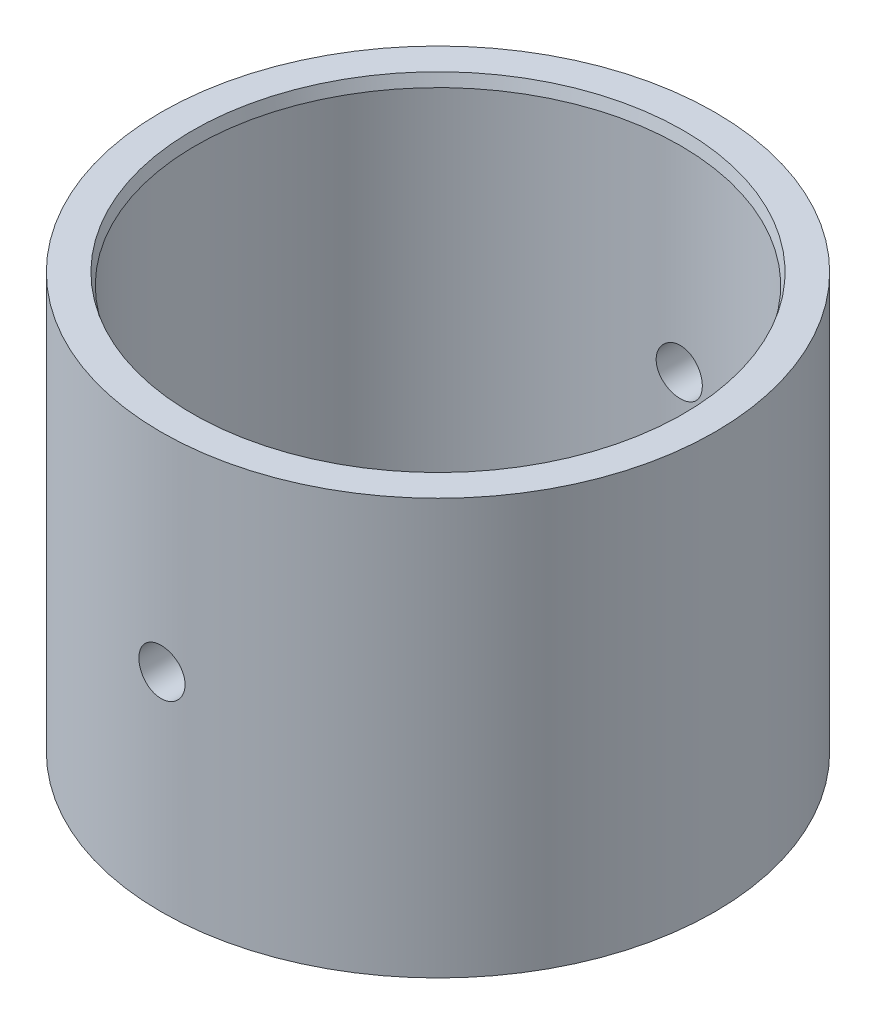
ISO-10303-21;
HEADER;
FILE_DESCRIPTION(('STEP AP214'),'2;1');
FILE_NAME('part.step','',(''),(''),'','','');
FILE_SCHEMA(('AUTOMOTIVE_DESIGN { 1 0 10303 214 1 1 1 1 }'));
ENDSEC;
DATA;
#1=APPLICATION_CONTEXT('core data for automotive mechanical design processes');
#2=APPLICATION_PROTOCOL_DEFINITION('international standard','automotive_design',2000,#1);
#3=PRODUCT_CONTEXT('',#1,'mechanical');
#4=PRODUCT('Part','Part','',(#3));
#5=PRODUCT_RELATED_PRODUCT_CATEGORY('part','',(#4));
#6=PRODUCT_DEFINITION_FORMATION('','',#4);
#7=PRODUCT_DEFINITION_CONTEXT('part definition',#1,'design');
#8=PRODUCT_DEFINITION('design','',#6,#7);
#9=PRODUCT_DEFINITION_SHAPE('','',#8);
#10=(LENGTH_UNIT() NAMED_UNIT(*) SI_UNIT(.MILLI.,.METRE.));
#11=(NAMED_UNIT(*) PLANE_ANGLE_UNIT() SI_UNIT($,.RADIAN.));
#12=(NAMED_UNIT(*) SI_UNIT($,.STERADIAN.) SOLID_ANGLE_UNIT());
#13=UNCERTAINTY_MEASURE_WITH_UNIT(LENGTH_MEASURE(1.E-05),#10,'distance_accuracy_value','');
#14=(GEOMETRIC_REPRESENTATION_CONTEXT(3) GLOBAL_UNCERTAINTY_ASSIGNED_CONTEXT((#13)) GLOBAL_UNIT_ASSIGNED_CONTEXT((#10,
#11,#12)) REPRESENTATION_CONTEXT('',''));
#15=CARTESIAN_POINT('',(0.,0.,0.));
#16=DIRECTION('',(0.,0.,1.));
#17=DIRECTION('',(1.,0.,0.));
#18=AXIS2_PLACEMENT_3D('',#15,#16,#17);
#19=CARTESIAN_POINT('',(0.,0.,0.));
#20=DIRECTION('',(0.,-1.,0.));
#21=DIRECTION('',(0.,0.,-1.));
#22=AXIS2_PLACEMENT_3D('',#19,#20,#21);
#23=CYLINDRICAL_SURFACE('',#22,24.);
#24=CARTESIAN_POINT('',(0.,20.,-24.));
#25=CARTESIAN_POINT('',(-0.112132179842408,19.9999951023475,-23.9999989082303));
#26=CARTESIAN_POINT('',(-0.224340694360451,19.9905380603779,-23.9992057708679));
#27=CARTESIAN_POINT('',(-0.445653141400779,19.9529512962899,-23.996118046565));
#28=CARTESIAN_POINT('',(-0.55475341045046,19.9248004193902,-23.9938217586339));
#29=CARTESIAN_POINT('',(-0.766612045028522,19.8506456923813,-23.9879872249221));
#30=CARTESIAN_POINT('',(-0.869373960849232,19.8046519437804,-23.9844496819697));
#31=CARTESIAN_POINT('',(-1.06569446683215,19.696135136256,-23.9765293548943));
#32=CARTESIAN_POINT('',(-1.15925501977078,19.633615613045,-23.9721467516272));
#33=CARTESIAN_POINT('',(-1.33477999993118,19.493649866788,-23.9630155973343));
#34=CARTESIAN_POINT('',(-1.41671774483233,19.4161702321286,-23.9582662417315));
#35=CARTESIAN_POINT('',(-1.56644226707311,19.2485542083002,-23.9489436160634));
#36=CARTESIAN_POINT('',(-1.63422842274301,19.1584172633948,-23.9443703537408));
#37=CARTESIAN_POINT('',(-1.75381584478046,18.967883765802,-23.9359090532249));
#38=CARTESIAN_POINT('',(-1.80559366590309,18.8674724491945,-23.9320220236018));
#39=CARTESIAN_POINT('',(-1.89154486754769,18.6593434088881,-23.9253824889655));
#40=CARTESIAN_POINT('',(-1.92571855902484,18.5516258142835,-23.9226299639126));
#41=CARTESIAN_POINT('',(-1.97541405963714,18.3322092162377,-23.9185778413264));
#42=CARTESIAN_POINT('',(-1.99097933077955,18.2205201200148,-23.9172748587244));
#43=CARTESIAN_POINT('',(-2.00315041603086,17.9961075921093,-23.9162586464295));
#44=CARTESIAN_POINT('',(-1.99975658595908,17.883384179878,-23.9165453869012));
#45=CARTESIAN_POINT('',(-1.9741417284297,17.660400668979,-23.9186731472327));
#46=CARTESIAN_POINT('',(-1.95196793607612,17.5501351018472,-23.9205102675571));
#47=CARTESIAN_POINT('',(-1.88949597076588,17.3348962652141,-23.9255256713873));
#48=CARTESIAN_POINT('',(-1.84919762079357,17.2299230474123,-23.928703967992));
#49=CARTESIAN_POINT('',(-1.75156757630407,17.0280981882438,-23.9360480941371));
#50=CARTESIAN_POINT('',(-1.69421468951439,16.931256844825,-23.9402151510193));
#51=CARTESIAN_POINT('',(-1.5641188878267,16.7485573223604,-23.9490661372776));
#52=CARTESIAN_POINT('',(-1.49137566124509,16.6626993658056,-23.9537500771206));
#53=CARTESIAN_POINT('',(-1.33229916445273,16.5041291614369,-23.9631244082329));
#54=CARTESIAN_POINT('',(-1.24592505878115,16.4314578717415,-23.9678147755013));
#55=CARTESIAN_POINT('',(-1.06218111274351,16.3016405532229,-23.9766598373967));
#56=CARTESIAN_POINT('',(-0.964811265030679,16.2444945347729,-23.9808145316657));
#57=CARTESIAN_POINT('',(-0.761813186535707,16.1473524746626,-23.9881209161928));
#58=CARTESIAN_POINT('',(-0.656184083618153,16.1073582470437,-23.9912725003489));
#59=CARTESIAN_POINT('',(-0.439678138039168,16.0456837350974,-23.996216348236));
#60=CARTESIAN_POINT('',(-0.328801404337715,16.0240030706895,-23.9980086401777));
#61=CARTESIAN_POINT('',(-0.105302600328507,15.9996224719169,-24.000028338861));
#62=CARTESIAN_POINT('',(0.00731325823038711,15.9968659637862,-24.00026040984));
#63=CARTESIAN_POINT('',(0.231405505006602,16.0102637212546,-23.999145975574));
#64=CARTESIAN_POINT('',(0.342881903842822,16.0264178104589,-23.9977994850535));
#65=CARTESIAN_POINT('',(0.561369512449395,16.0771313172202,-23.9936823568264));
#66=CARTESIAN_POINT('',(0.66838685027944,16.1116645120516,-23.9909137483484));
#67=CARTESIAN_POINT('',(0.875108330164975,16.1981291755641,-23.984263402247));
#68=CARTESIAN_POINT('',(0.974812356566261,16.250060919317,-23.9803816470248));
#69=CARTESIAN_POINT('',(1.16433443660381,16.3699906984327,-23.9719285278726));
#70=CARTESIAN_POINT('',(1.25412870104294,16.4380262127897,-23.9673555643747));
#71=CARTESIAN_POINT('',(1.42104218968724,16.588178114101,-23.958039172794));
#72=CARTESIAN_POINT('',(1.49816119362876,16.6702947456986,-23.9532957417505));
#73=CARTESIAN_POINT('',(1.6377290909102,16.8465233843967,-23.9441592243164));
#74=CARTESIAN_POINT('',(1.70014106646727,16.9406646823948,-23.9397670374845));
#75=CARTESIAN_POINT('',(1.80827012567903,17.1381245257268,-23.9318430348864));
#76=CARTESIAN_POINT('',(1.85398737601992,17.2414429794199,-23.9283112105303));
#77=CARTESIAN_POINT('',(1.92736635488113,17.4541935810785,-23.9225128569788));
#78=CARTESIAN_POINT('',(1.95505068289858,17.5636178894287,-23.9202447445727));
#79=CARTESIAN_POINT('',(1.9916515398203,17.7855813997489,-23.917225313817));
#80=CARTESIAN_POINT('',(2.00056842913653,17.8981205418592,-23.9164739663394));
#81=CARTESIAN_POINT('',(1.99937712578186,18.1227522520418,-23.9165735590039));
#82=CARTESIAN_POINT('',(1.98932693955478,18.2348451344729,-23.9174196138614));
#83=CARTESIAN_POINT('',(1.95060772659006,18.4557450671017,-23.9206083016461));
#84=CARTESIAN_POINT('',(1.92193867145525,18.5645521122877,-23.9229509368559));
#85=CARTESIAN_POINT('',(1.84681022003412,18.7757955265333,-23.9288675426341));
#86=CARTESIAN_POINT('',(1.80035186801306,18.8782322691314,-23.9324414409238));
#87=CARTESIAN_POINT('',(1.6909701178945,19.0738616811474,-23.9404179975014));
#88=CARTESIAN_POINT('',(1.62804697822912,19.1670544956267,-23.944820642781));
#89=CARTESIAN_POINT('',(1.4873038842449,19.341847478026,-23.9539746339736));
#90=CARTESIAN_POINT('',(1.40944098748292,19.4234130173147,-23.9587269601149));
#91=CARTESIAN_POINT('',(1.24110645118493,19.5723503704067,-23.9680359001936));
#92=CARTESIAN_POINT('',(1.15063176528218,19.639718744992,-23.9725924664965));
#93=CARTESIAN_POINT('',(0.95946754605883,19.7584397208351,-23.9810046968455));
#94=CARTESIAN_POINT('',(0.858759312541077,19.8097622773127,-23.9848590404621));
#95=CARTESIAN_POINT('',(0.650191503991467,19.8947036061026,-23.991417050326));
#96=CARTESIAN_POINT('',(0.542340310827302,19.9283427285762,-23.9941220385651));
#97=CARTESIAN_POINT('',(0.361544096193359,19.9683951650041,-23.997382154677));
#98=CARTESIAN_POINT('',(0.289761788876941,19.980231225035,-23.9983593775391));
#99=CARTESIAN_POINT('',(0.145330343002325,19.9960352193544,-23.9996686531727));
#100=CARTESIAN_POINT('',(0.0726812067460898,20.000003174533,-24.0000007076571));
#101=CARTESIAN_POINT('',(0.,20.,-24.));
#102=B_SPLINE_CURVE_WITH_KNOTS('',3,(#24,#25,#26,#27,#28,#29,#30,#31,#32,#33,#34,#35,#36,#37,
#38,#39,#40,#41,#42,#43,#44,#45,#46,#47,#48,#49,#50,#51,#52,#53,#54,#55,#56,#57,#58,#59,#60,#61,
#62,#63,#64,#65,#66,#67,#68,#69,#70,#71,#72,#73,#74,#75,#76,#77,#78,#79,#80,#81,#82,#83,#84,#85,
#86,#87,#88,#89,#90,#91,#92,#93,#94,#95,#96,#97,#98,#99,#100,#101),.UNSPECIFIED.,.T.,.F.,(4,2,2,
2,2,2,2,2,2,2,2,2,2,2,2,2,2,2,2,2,2,2,2,2,2,2,2,2,2,2,2,2,2,2,2,2,2,2,4),(0.,0.336131173600278,
0.672643377995671,1.00896534777791,1.34521541916836,1.68222533757153,2.01925005747863,
2.35676605902183,2.69427609855802,3.03099629663173,3.36771017525238,3.70357966220579,
4.03945242953998,4.37574431497799,4.7120430116172,5.04936901870299,5.3866952511729,
5.72405715180901,6.0614120506507,6.39775798614337,6.73410078428443,7.06996498061571,
7.40583448722745,7.74249349949854,8.07915836142501,8.41665952982404,8.75415732839656,
9.09123134481857,9.42829888797516,9.76433725765055,10.1003761398468,10.4363952989505,
10.7724091841971,11.1094037732928,11.4464799046496,11.7841834612511,12.1214975318357,
12.3393697271332,12.5572413439749),.UNSPECIFIED.);
#103=CARTESIAN_POINT('',(0.,20.,-24.));
#104=VERTEX_POINT('',#103);
#105=EDGE_CURVE('E75',#104,#104,#102,.T.);
#106=ORIENTED_EDGE('',*,*,#105,.T.);
#107=EDGE_LOOP('',(#106));
#108=FACE_BOUND('',#107,.T.);
#109=CARTESIAN_POINT('',(2.,18.,23.9165214862028));
#110=CARTESIAN_POINT('',(1.99999510166076,17.8878685824192,23.9165225921672));
#111=CARTESIAN_POINT('',(1.99053818391964,17.7756608276847,23.9173185596524));
#112=CARTESIAN_POINT('',(1.95295195814858,17.5543499593132,23.9204163949853));
#113=CARTESIAN_POINT('',(1.92480149272331,17.4452505097448,23.9227199691026));
#114=CARTESIAN_POINT('',(1.85064796947505,17.2333936077494,23.9285703099202));
#115=CARTESIAN_POINT('',(1.80465503275105,17.1306325980901,23.9321163717121));
#116=CARTESIAN_POINT('',(1.69614013697091,16.9343136095802,23.9400512540324));
#117=CARTESIAN_POINT('',(1.63362171162538,16.8407536690899,23.944439894334));
#118=CARTESIAN_POINT('',(1.49365707291607,16.6652279938667,23.9535780955897));
#119=CARTESIAN_POINT('',(1.41617720280375,16.5832891362741,23.9583284553806));
#120=CARTESIAN_POINT('',(1.24856024135219,16.433562467524,23.9676475322155));
#121=CARTESIAN_POINT('',(1.15842259730736,16.3657752746248,23.9722162413165));
#122=CARTESIAN_POINT('',(0.96788849061758,16.2461867706877,23.9806648101503));
#123=CARTESIAN_POINT('',(0.867477384251718,16.1944087136371,23.9845436643989));
#124=CARTESIAN_POINT('',(0.659348800997525,16.108457017763,23.9911668754458));
#125=CARTESIAN_POINT('',(0.551631452032323,16.0742830708036,23.9939112521013));
#126=CARTESIAN_POINT('',(0.332215591895622,16.0245870322879,23.9979507090534));
#127=CARTESIAN_POINT('',(0.220526992464643,16.0090214577611,23.999249167599));
#128=CARTESIAN_POINT('',(-0.00388456377963857,15.9968495936308,24.0002619346845));
#129=CARTESIAN_POINT('',(-0.116607501319097,16.0002429514602,23.9999762726832));
#130=CARTESIAN_POINT('',(-0.33959310303763,16.0258570643588,23.9978557727758));
#131=CARTESIAN_POINT('',(-0.449861180144931,16.0480310596084,23.9960247824506));
#132=CARTESIAN_POINT('',(-0.665104932080491,16.1105043019242,23.9910239970924));
#133=CARTESIAN_POINT('',(-0.770080556543006,16.1508037214451,23.9878541893213));
#134=CARTESIAN_POINT('',(-0.971908321273714,16.2484359742372,23.9805257582459));
#135=CARTESIAN_POINT('',(-1.06875028531795,16.3057897491975,23.9763659205073));
#136=CARTESIAN_POINT('',(-1.25145067175474,16.4358874431573,23.967524905385));
#137=CARTESIAN_POINT('',(-1.33730887129974,16.5086316743313,23.9628437174275));
#138=CARTESIAN_POINT('',(-1.4958779295638,16.6677088799105,23.9534692949454));
#139=CARTESIAN_POINT('',(-1.56854803333006,16.7540824856376,23.9487760670533));
#140=CARTESIAN_POINT('',(-1.69836319784541,16.9378250102327,23.9399208354476));
#141=CARTESIAN_POINT('',(-1.75550824579663,17.0351939381644,23.9357588321719));
#142=CARTESIAN_POINT('',(-1.85264960918651,17.2381917755436,23.9284365219397));
#143=CARTESIAN_POINT('',(-1.8926438094694,17.3438217018938,23.9252763385469));
#144=CARTESIAN_POINT('',(-1.95431801405702,17.560329436102,23.9203178655996));
#145=CARTESIAN_POINT('',(-1.97599840338961,17.6712071335796,23.9185195474136));
#146=CARTESIAN_POINT('',(-2.00037796582524,17.8947063731106,23.9164930579307));
#147=CARTESIAN_POINT('',(-2.00313397223578,18.0073216748938,23.9162601853648));
#148=CARTESIAN_POINT('',(-1.98973541008965,18.2314126872993,23.9173785442764));
#149=CARTESIAN_POINT('',(-1.97358101791765,18.3428884085411,23.9187297609784));
#150=CARTESIAN_POINT('',(-1.92286760248496,18.5613727115991,23.9228597628949));
#151=CARTESIAN_POINT('',(-1.8883351019789,18.6683874919262,23.9256364906494));
#152=CARTESIAN_POINT('',(-1.80187268445968,18.8751041643275,23.9323029395923));
#153=CARTESIAN_POINT('',(-1.74994248829414,18.9748059390306,23.9361926786391));
#154=CARTESIAN_POINT('',(-1.6300149759579,19.1643265044385,23.9446582692637));
#155=CARTESIAN_POINT('',(-1.56197978737008,19.2541212567969,23.9492357286682));
#156=CARTESIAN_POINT('',(-1.41182825683102,19.4210358818137,23.9585555554756));
#157=CARTESIAN_POINT('',(-1.32971167257854,19.4981555363247,23.9632979257151));
#158=CARTESIAN_POINT('',(-1.15348274582349,19.6377248115401,23.9724272221765));
#159=CARTESIAN_POINT('',(-1.05934110481966,19.7001375060063,23.9768132359615));
#160=CARTESIAN_POINT('',(-0.861880386428811,19.8082678271291,23.9847224774212));
#161=CARTESIAN_POINT('',(-0.758561400763555,19.8539856206174,23.9882457137175));
#162=CARTESIAN_POINT('',(-0.545811157534078,19.9273649648322,23.994028224387));
#163=CARTESIAN_POINT('',(-0.436387821041215,19.9550493502917,23.9962890967033));
#164=CARTESIAN_POINT('',(-0.214426358132601,19.9916506515082,23.9992986265966));
#165=CARTESIAN_POINT('',(-0.10188829071566,20.0005679225032,24.0000473127974));
#166=CARTESIAN_POINT('',(0.122744096791801,19.9993777207981,23.9999481574676));
#167=CARTESIAN_POINT('',(0.23483872842277,19.9893277963229,23.9991051452937));
#168=CARTESIAN_POINT('',(0.455742224122665,19.9506084909769,23.9959268679109));
#169=CARTESIAN_POINT('',(0.564551083728559,19.9219390848166,23.9935916006751));
#170=CARTESIAN_POINT('',(0.775798092897501,19.8468092597553,23.9876908340787));
#171=CARTESIAN_POINT('',(0.878236612240519,19.8003498746341,23.9841254062043));
#172=CARTESIAN_POINT('',(1.07386914579804,19.6909655092046,23.9761631992158));
#173=CARTESIAN_POINT('',(1.16706330617211,19.6280407892816,23.9717664332491));
#174=CARTESIAN_POINT('',(1.34185617885092,19.4872959703018,23.9626191700326));
#175=CARTESIAN_POINT('',(1.42342055196923,19.4094332893069,23.9578676858697));
#176=CARTESIAN_POINT('',(1.57235565311909,19.2410996625481,23.9485548996043));
#177=CARTESIAN_POINT('',(1.63972293889646,19.1506256678342,23.9439936438395));
#178=CARTESIAN_POINT('',(1.75844275795771,18.9594619985981,23.9355684881736));
#179=CARTESIAN_POINT('',(1.80976504691693,18.8587534999976,23.9317059109641));
#180=CARTESIAN_POINT('',(1.89470580186759,18.6501851265308,23.9251315921052));
#181=CARTESIAN_POINT('',(1.92834462185893,18.5423336351656,23.922418528046));
#182=CARTESIAN_POINT('',(1.96839619601217,18.3615382315456,23.9191481637613));
#183=CARTESIAN_POINT('',(1.98023186811687,18.2897570944429,23.9181676877811));
#184=CARTESIAN_POINT('',(1.99603534701332,18.1453279936503,23.916853991446));
#185=CARTESIAN_POINT('',(2.0000031749483,18.0726800322904,23.9165207693517));
#186=CARTESIAN_POINT('',(2.,18.,23.9165214862028));
#187=B_SPLINE_CURVE_WITH_KNOTS('',3,(#109,#110,#111,#112,#113,#114,#115,#116,#117,#118,#119,
#120,#121,#122,#123,#124,#125,#126,#127,#128,#129,#130,#131,#132,#133,#134,#135,#136,#137,#138,
#139,#140,#141,#142,#143,#144,#145,#146,#147,#148,#149,#150,#151,#152,#153,#154,#155,#156,#157,
#158,#159,#160,#161,#162,#163,#164,#165,#166,#167,#168,#169,#170,#171,#172,#173,#174,#175,#176,
#177,#178,#179,#180,#181,#182,#183,#184,#185,#186),.UNSPECIFIED.,.T.,.F.,(4,2,2,2,2,2,2,2,2,2,2,
2,2,2,2,2,2,2,2,2,2,2,2,2,2,2,2,2,2,2,2,2,2,2,2,2,2,2,4),(0.,0.336128884101191,
0.672638849434344,1.00895820875438,1.34520570967165,1.6822186237835,2.01924625824601,
2.35676116520944,2.69427016423555,3.03098894044045,3.36770145492209,3.70357808249366,
4.03945790583951,4.3757518840201,4.71205268412495,5.04937568045611,5.38669895485413,
5.72406381822961,6.06142158870086,6.39776576859814,6.73410681130696,7.06996376739613,
7.4058261126909,7.74248625686011,8.07915219458568,8.41665463473969,8.75415370214925,
9.09122457762007,9.42828907270388,9.7643325267479,10.100376437216,10.4364008230566,
10.7724198952774,11.1094114464739,11.4464846115476,11.7841893707743,12.1215045697477,
12.339373248552,12.5572413418775),.UNSPECIFIED.);
#188=CARTESIAN_POINT('',(2.,18.,23.9165214862028));
#189=VERTEX_POINT('',#188);
#190=EDGE_CURVE('E71',#189,#189,#187,.T.);
#191=ORIENTED_EDGE('',*,*,#190,.T.);
#192=EDGE_LOOP('',(#191));
#193=FACE_BOUND('',#192,.T.);
#194=CARTESIAN_POINT('',(0.,0.,0.));
#195=DIRECTION('',(0.,-1.,0.));
#196=DIRECTION('',(0.,0.,-1.));
#197=AXIS2_PLACEMENT_3D('',#194,#195,#196);
#198=CIRCLE('',#197,24.);
#199=CARTESIAN_POINT('',(0.,0.,-24.));
#200=VERTEX_POINT('',#199);
#201=EDGE_CURVE('E80',#200,#200,#198,.T.);
#202=ORIENTED_EDGE('',*,*,#201,.F.);
#203=EDGE_LOOP('',(#202));
#204=FACE_BOUND('',#203,.T.);
#205=CARTESIAN_POINT('',(0.,36.,0.));
#206=DIRECTION('',(0.,-1.,0.));
#207=DIRECTION('',(0.,0.,-1.));
#208=AXIS2_PLACEMENT_3D('',#205,#206,#207);
#209=CIRCLE('',#208,24.);
#210=CARTESIAN_POINT('',(0.,36.,-24.));
#211=VERTEX_POINT('',#210);
#212=EDGE_CURVE('E10',#211,#211,#209,.T.);
#213=ORIENTED_EDGE('',*,*,#212,.T.);
#214=EDGE_LOOP('',(#213));
#215=FACE_BOUND('',#214,.T.);
#216=ADVANCED_FACE('F31',(#108,#193,#204,#215),#23,.T.);
#217=CARTESIAN_POINT('',(-24.,36.,0.));
#218=DIRECTION('',(0.,-1.,0.));
#219=DIRECTION('',(0.,0.,-1.));
#220=AXIS2_PLACEMENT_3D('',#217,#218,#219);
#221=PLANE('',#220);
#222=ORIENTED_EDGE('',*,*,#212,.F.);
#223=EDGE_LOOP('',(#222));
#224=FACE_BOUND('',#223,.T.);
#225=CARTESIAN_POINT('',(0.,36.,0.));
#226=DIRECTION('',(0.,-1.,0.));
#227=DIRECTION('',(0.,0.,-1.));
#228=AXIS2_PLACEMENT_3D('',#225,#226,#227);
#229=CIRCLE('',#228,21.2679491924311);
#230=CARTESIAN_POINT('',(0.,36.,-21.2679491924311));
#231=VERTEX_POINT('',#230);
#232=EDGE_CURVE('E43',#231,#231,#229,.T.);
#233=ORIENTED_EDGE('',*,*,#232,.T.);
#234=EDGE_LOOP('',(#233));
#235=FACE_BOUND('',#234,.T.);
#236=ADVANCED_FACE('F108',(#224,#235),#221,.F.);
#237=CARTESIAN_POINT('',(0.,35.,0.));
#238=DIRECTION('',(0.,1.,0.));
#239=DIRECTION('',(0.,0.,1.));
#240=AXIS2_PLACEMENT_3D('',#237,#238,#239);
#241=CONICAL_SURFACE('',#240,21.,0.26179938779915);
#242=ORIENTED_EDGE('',*,*,#232,.F.);
#243=EDGE_LOOP('',(#242));
#244=FACE_BOUND('',#243,.T.);
#245=CARTESIAN_POINT('',(0.,35.,0.));
#246=DIRECTION('',(0.,-1.,0.));
#247=DIRECTION('',(0.,0.,-1.));
#248=AXIS2_PLACEMENT_3D('',#245,#246,#247);
#249=CIRCLE('',#248,21.);
#250=CARTESIAN_POINT('',(0.,35.,-21.));
#251=VERTEX_POINT('',#250);
#252=EDGE_CURVE('E48',#251,#251,#249,.T.);
#253=ORIENTED_EDGE('',*,*,#252,.T.);
#254=EDGE_LOOP('',(#253));
#255=FACE_BOUND('',#254,.T.);
#256=ADVANCED_FACE('F91',(#244,#255),#241,.F.);
#257=CARTESIAN_POINT('',(0.,0.,0.));
#258=DIRECTION('',(0.,-1.,0.));
#259=DIRECTION('',(0.,0.,-1.));
#260=AXIS2_PLACEMENT_3D('',#257,#258,#259);
#261=CYLINDRICAL_SURFACE('',#260,21.);
#262=CARTESIAN_POINT('',(0.,20.,-21.));
#263=CARTESIAN_POINT('',(0.11206851677612,19.9999951336632,-20.9999987657527));
#264=CARTESIAN_POINT('',(0.224211796574337,19.9905487807758,-20.9990933615042));
#265=CARTESIAN_POINT('',(0.445391214374538,19.9530069564164,-20.9955685836232));
#266=CARTESIAN_POINT('',(0.554423759092796,19.9248907617359,-20.9929473054456));
#267=CARTESIAN_POINT('',(0.76614664553749,19.8508335153622,-20.9862867729396));
#268=CARTESIAN_POINT('',(0.868840702607793,19.8049030228822,-20.9822483587365));
#269=CARTESIAN_POINT('',(1.06503875589894,19.6965409991582,-20.9732055207603));
#270=CARTESIAN_POINT('',(1.15854461624237,19.6341128245237,-20.9682012935468));
#271=CARTESIAN_POINT('',(1.33404172874987,19.4943074501416,-20.9577693387054));
#272=CARTESIAN_POINT('',(1.41599863469433,19.4168872206627,-20.9523404195341));
#273=CARTESIAN_POINT('',(1.56577632072926,19.2493869804021,-20.9416808499756));
#274=CARTESIAN_POINT('',(1.63359645719823,19.1593063935297,-20.9364502086244));
#275=CARTESIAN_POINT('',(1.75329562407415,18.968829427795,-20.9267670840772));
#276=CARTESIAN_POINT('',(1.80514381881881,18.8684135877763,-20.9223161131791));
#277=CARTESIAN_POINT('',(1.89123040983961,18.6602516998984,-20.914710759878));
#278=CARTESIAN_POINT('',(1.92546920328435,18.5525058174257,-20.9115563482324));
#279=CARTESIAN_POINT('',(1.97526385038332,18.3330910222469,-20.9069118399908));
#280=CARTESIAN_POINT('',(1.99087640322828,18.2214350857005,-20.9054166934852));
#281=CARTESIAN_POINT('',(2.00315062174034,17.997078355183,-20.9042442492669));
#282=CARTESIAN_POINT('',(1.99981274210575,17.8843775863466,-20.9045669079377));
#283=CARTESIAN_POINT('',(1.97432761579553,17.6615204998268,-20.9069890119905));
#284=CARTESIAN_POINT('',(1.95224218900049,17.5513570402711,-20.9090826176102));
#285=CARTESIAN_POINT('',(1.88998503838197,17.3363076086893,-20.9148015868931));
#286=CARTESIAN_POINT('',(1.84981309072563,17.2314217019944,-20.918426969513));
#287=CARTESIAN_POINT('',(1.75245469773469,17.029708891148,-20.9268077262985));
#288=CARTESIAN_POINT('',(1.69524073130833,16.9328953491995,-20.9315649257106));
#289=CARTESIAN_POINT('',(1.56544218968724,16.7502216393462,-20.9416717165532));
#290=CARTESIAN_POINT('',(1.49285720670951,16.6643617621318,-20.9470213236979));
#291=CARTESIAN_POINT('',(1.33403133273958,16.5056733295126,-20.9577361766818));
#292=CARTESIAN_POINT('',(1.24773703589184,16.4328982139649,-20.9631013995991));
#293=CARTESIAN_POINT('',(1.06412782329131,16.3028590142924,-20.9732227225575));
#294=CARTESIAN_POINT('',(0.966812896857345,16.2455949452009,-20.9779788220083));
#295=CARTESIAN_POINT('',(0.763888508919955,16.1482058583886,-20.9863473687051));
#296=CARTESIAN_POINT('',(0.658277788825422,16.1080834472721,-20.9899596419964));
#297=CARTESIAN_POINT('',(0.441776710460548,16.0461552368577,-20.9956316971842));
#298=CARTESIAN_POINT('',(0.3308864954477,16.0243489408566,-20.9976915211806));
#299=CARTESIAN_POINT('',(0.107437110645361,15.9997395149422,-21.0000211858996));
#300=CARTESIAN_POINT('',(-0.00511386573308089,15.9968626203559,-21.0002979747199));
#301=CARTESIAN_POINT('',(-0.229096416451458,16.0100000737498,-20.9990489909623));
#302=CARTESIAN_POINT('',(-0.340528004469119,16.0260141906182,-20.9975232404366));
#303=CARTESIAN_POINT('',(-0.55889652299464,16.0764179060193,-20.9928451258125));
#304=CARTESIAN_POINT('',(-0.665841472079162,16.110773071789,-20.9896958101106));
#305=CARTESIAN_POINT('',(-0.872449925522378,16.1968483484752,-20.9821240167587));
#306=CARTESIAN_POINT('',(-0.97211328103516,16.2485688142419,-20.977701513092));
#307=CARTESIAN_POINT('',(-1.16166364758811,16.3680902133495,-20.9680610402664));
#308=CARTESIAN_POINT('',(-1.25151989860657,16.4359397338388,-20.962840684964));
#309=CARTESIAN_POINT('',(-1.41859426207766,16.5857234200442,-20.9521982673831));
#310=CARTESIAN_POINT('',(-1.49581208714991,16.6676579059462,-20.9467762005213));
#311=CARTESIAN_POINT('',(-1.6356728496386,16.8436070296303,-20.9363206553458));
#312=CARTESIAN_POINT('',(-1.69826745851642,16.937660173166,-20.931288501279));
#313=CARTESIAN_POINT('',(-1.80677298811757,17.1349863388947,-20.9222022907873));
#314=CARTESIAN_POINT('',(-1.85268411852468,17.23825924519,-20.9181482220699));
#315=CARTESIAN_POINT('',(-1.92643810362524,17.4509260219406,-20.9114852355905));
#316=CARTESIAN_POINT('',(-1.95430996541365,17.5603097569211,-20.908873998753));
#317=CARTESIAN_POINT('',(-1.99128845167282,17.7822306389035,-20.9053849705758));
#318=CARTESIAN_POINT('',(-2.0003955599328,17.8947677045309,-20.904507134546));
#319=CARTESIAN_POINT('',(-1.99957965543844,18.1193204112423,-20.9045851574728));
#320=CARTESIAN_POINT('',(-1.98973256440784,18.2313363384908,-20.9055337008063));
#321=CARTESIAN_POINT('',(-1.95144670486273,18.4521151722055,-20.9091420241887));
#322=CARTESIAN_POINT('',(-1.92300791295353,18.5608780745783,-20.9118018063909));
#323=CARTESIAN_POINT('',(-1.84836636813638,18.7720645468326,-20.9185309204015));
#324=CARTESIAN_POINT('',(-1.8021655900812,18.8744888200005,-20.9226000955027));
#325=CARTESIAN_POINT('',(-1.69331953420134,19.070140642369,-20.9316898132485));
#326=CARTESIAN_POINT('',(-1.63067439867938,19.1633682711439,-20.9367103476604));
#327=CARTESIAN_POINT('',(-1.49043254352323,19.3383694535788,-20.9471611474809));
#328=CARTESIAN_POINT('',(-1.41277932098119,19.4200976383254,-20.9525929125481));
#329=CARTESIAN_POINT('',(-1.24483526135108,19.5693980936744,-20.9632404290988));
#330=CARTESIAN_POINT('',(-1.15454139260207,19.6369669586505,-20.9684561283723));
#331=CARTESIAN_POINT('',(-0.963653566400372,19.7561511067566,-20.9780961749348));
#332=CARTESIAN_POINT('',(-0.863036245493354,19.8077290908591,-20.9825186620727));
#333=CARTESIAN_POINT('',(-0.654592623795239,19.8931900736557,-20.9900533668106));
#334=CARTESIAN_POINT('',(-0.546774656981876,19.9270931421042,-20.9931670697447));
#335=CARTESIAN_POINT('',(-0.365281964754241,19.9677330052529,-20.9969458270611));
#336=CARTESIAN_POINT('',(-0.292769649140976,19.9798167331665,-20.9980858398782));
#337=CARTESIAN_POINT('',(-0.146848922285721,19.9959518103554,-20.9996133293842));
#338=CARTESIAN_POINT('',(-0.0734405143209534,20.000003188998,-21.0000008088244));
#339=CARTESIAN_POINT('',(0.,20.,-21.));
#340=B_SPLINE_CURVE_WITH_KNOTS('',3,(#262,#263,#264,#265,#266,#267,#268,#269,#270,#271,#272,
#273,#274,#275,#276,#277,#278,#279,#280,#281,#282,#283,#284,#285,#286,#287,#288,#289,#290,#291,
#292,#293,#294,#295,#296,#297,#298,#299,#300,#301,#302,#303,#304,#305,#306,#307,#308,#309,#310,
#311,#312,#313,#314,#315,#316,#317,#318,#319,#320,#321,#322,#323,#324,#325,#326,#327,#328,#329,
#330,#331,#332,#333,#334,#335,#336,#337,#338,#339),.UNSPECIFIED.,.T.,.F.,(4,2,2,2,2,2,2,2,2,2,2,
2,2,2,2,2,2,2,2,2,2,2,2,2,2,2,2,2,2,2,2,2,2,2,2,2,2,2,4),(0.,0.335937385068524,
0.672248279659346,1.00836013386275,1.34440365550981,1.68142637052986,2.01846442623356,
2.35614915245234,2.69382626207779,3.03047282169353,3.36711130381705,3.70264401629965,
4.03818088133937,4.37426256874089,4.71035317328673,5.04778669012683,5.38522053400915,
5.72270567069922,6.06018165504596,6.39634176977744,6.73249777198433,7.0680248960164,
7.40355887677234,7.74011672254087,8.07668222010799,8.41434478201833,8.75200309992107,
9.08911710627295,9.4262224211084,9.7619802579775,10.0977385173448,10.4334594564794,
10.7691774905188,11.1061849733199,11.4432734209969,11.7811423189666,12.1186267287274,
12.3387733430605,12.5589191525063),.UNSPECIFIED.);
#341=CARTESIAN_POINT('',(0.,20.,-21.));
#342=VERTEX_POINT('',#341);
#343=EDGE_CURVE('E35',#342,#342,#340,.T.);
#344=ORIENTED_EDGE('',*,*,#343,.T.);
#345=EDGE_LOOP('',(#344));
#346=FACE_BOUND('',#345,.T.);
#347=CARTESIAN_POINT('',(2.,18.,20.9045449603669));
#348=CARTESIAN_POINT('',(1.9999951324983,18.1120672171884,20.9045462156178));
#349=CARTESIAN_POINT('',(1.99054899129273,18.2242092015242,20.9054558413958));
#350=CARTESIAN_POINT('',(1.95300808418775,18.4453859276932,20.9089956997207));
#351=CARTESIAN_POINT('',(1.92489259059455,18.5544170752252,20.9116278446518));
#352=CARTESIAN_POINT('',(1.85083739514533,18.7661370073773,20.9183119483273));
#353=CARTESIAN_POINT('',(1.80490828584927,18.8688295191723,20.9223630631674));
#354=CARTESIAN_POINT('',(1.69654951936901,19.0650249835741,20.9314276044133));
#355=CARTESIAN_POINT('',(1.63412321539528,19.1585297983746,20.9364408352034));
#356=CARTESIAN_POINT('',(1.49431973012888,19.334028092781,20.9468833487012));
#357=CARTESIAN_POINT('',(1.41689910122776,19.4159868946944,20.9523138121072));
#358=CARTESIAN_POINT('',(1.24939726622698,19.5657682396101,20.962968170606));
#359=CARTESIAN_POINT('',(1.15931548920827,19.633590144806,20.9681920563701));
#360=CARTESIAN_POINT('',(0.968837481972113,19.7532911602435,20.977856206977));
#361=CARTESIAN_POINT('',(0.868421995251549,19.805139759945,20.9822949653519));
#362=CARTESIAN_POINT('',(0.660260875297452,19.8912271971253,20.9898759182748));
#363=CARTESIAN_POINT('',(0.55251540544737,19.9254664269671,20.9930181417111));
#364=CARTESIAN_POINT('',(0.333101868304561,19.9752619874399,20.9976437034526));
#365=CARTESIAN_POINT('',(0.221446785216088,19.9908750549222,20.9991320785634));
#366=CARTESIAN_POINT('',(-0.00290827463719659,20.003150598403,21.000299357107));
#367=CARTESIAN_POINT('',(-0.115608226574182,19.999813523542,20.9999783034253));
#368=CARTESIAN_POINT('',(-0.338468865831164,19.9743296700468,20.9975670307462));
#369=CARTESIAN_POINT('',(-0.448636600299239,19.9522439012185,20.9954825501619));
#370=CARTESIAN_POINT('',(-0.66369440515951,19.8899845842188,20.9897853391345));
#371=CARTESIAN_POINT('',(-0.768584412477904,19.8498108199359,20.986172590432));
#372=CARTESIAN_POINT('',(-0.970302188981354,19.7524486682357,20.9778152259173));
#373=CARTESIAN_POINT('',(-1.067116801887,19.695233184034,20.9730688099432));
#374=CARTESIAN_POINT('',(-1.249792009696,19.565431404489,20.9629769450517));
#375=CARTESIAN_POINT('',(-1.3356523133329,19.4928447005735,20.957631480213));
#376=CARTESIAN_POINT('',(-1.49433879706903,19.3340176076279,20.9469166086364));
#377=CARTESIAN_POINT('',(-1.56711188493342,19.2477241636696,20.9415471910896));
#378=CARTESIAN_POINT('',(-1.69714740011326,19.0641173793405,20.9314108048732));
#379=CARTESIAN_POINT('',(-1.75440980821377,18.9668040253181,20.9266438369499));
#380=CARTESIAN_POINT('',(-1.85179770081665,18.7638800596788,20.9182515196685));
#381=CARTESIAN_POINT('',(-1.89192006512271,18.658267941483,20.9146263782015));
#382=CARTESIAN_POINT('',(-1.95384775332463,18.4417638247124,20.908932412349));
#383=CARTESIAN_POINT('',(-1.97565358238456,18.33087197184,20.9068635450421));
#384=CARTESIAN_POINT('',(-2.00026124765118,18.1074218309654,20.9045236747482));
#385=CARTESIAN_POINT('',(-2.0031372873688,17.9948717851794,20.9042456518622));
#386=CARTESIAN_POINT('',(-1.98999845641437,17.7708913011471,20.9055004243198));
#387=CARTESIAN_POINT('',(-1.97398381686837,17.6594608492195,20.9070331975084));
#388=CARTESIAN_POINT('',(-1.92358023952317,17.4410979523075,20.911730467342));
#389=CARTESIAN_POINT('',(-1.88922624892607,17.3341573681872,20.9148918601136));
#390=CARTESIAN_POINT('',(-1.80315478481641,17.1275571246046,20.9224876266238));
#391=CARTESIAN_POINT('',(-1.75143694952917,17.0278976168957,20.9269220268852));
#392=CARTESIAN_POINT('',(-1.63191941755748,16.8383498639034,20.9365811667517));
#393=CARTESIAN_POINT('',(-1.56407046533129,16.7484928005466,20.9418083088951));
#394=CARTESIAN_POINT('',(-1.41428744372515,16.5814165332804,20.9524560261412));
#395=CARTESIAN_POINT('',(-1.33235305809982,16.5041976131979,20.9578766055849));
#396=CARTESIAN_POINT('',(-1.15640345467238,16.3643344961117,20.9683215407437));
#397=CARTESIAN_POINT('',(-1.06234971365102,16.3017386470322,20.9733445467704));
#398=CARTESIAN_POINT('',(-0.865022023354612,16.1932309412019,20.9824087916211));
#399=CARTESIAN_POINT('',(-0.761748190166647,16.1473188744279,20.9864500428037));
#400=CARTESIAN_POINT('',(-0.54908200792104,16.0735642675548,20.9930893097537));
#401=CARTESIAN_POINT('',(-0.439699935771874,16.0456923146705,20.9956896737568));
#402=CARTESIAN_POINT('',(-0.217782559799097,16.0087130827311,20.9991637819814));
#403=CARTESIAN_POINT('',(-0.10524733585284,15.9996053287658,21.0000375699014));
#404=CARTESIAN_POINT('',(0.119306488360056,16.0004193544649,20.9999600792523));
#405=CARTESIAN_POINT('',(0.231325371121807,16.0102659908033,20.9990160074537));
#406=CARTESIAN_POINT('',(0.452110229122015,16.0485519808808,20.9954230979906));
#407=CARTESIAN_POINT('',(0.560876201181954,16.0769913527869,20.9927742586603));
#408=CARTESIAN_POINT('',(0.77206880923202,16.151635210486,20.9860687172625));
#409=CARTESIAN_POINT('',(0.87449613938822,16.1978377469636,20.9820121696803));
#410=CARTESIAN_POINT('',(1.07015334160686,16.306688265712,20.9729438951492));
#411=CARTESIAN_POINT('',(1.16338329513741,16.3693361022964,20.9679321766621));
#412=CARTESIAN_POINT('',(1.33838433013862,16.5095809232995,20.9574916013533));
#413=CARTESIAN_POINT('',(1.42011053564334,16.5872337932059,20.9520612322109));
#414=CARTESIAN_POINT('',(1.56940716245365,16.7551763338756,20.9414082343013));
#415=CARTESIAN_POINT('',(1.63697417295402,16.8454690407288,20.9361856558337));
#416=CARTESIAN_POINT('',(1.75615633094976,17.0363559251813,20.9265264571936));
#417=CARTESIAN_POINT('',(1.80773384481054,17.1369736751343,20.9220917015874));
#418=CARTESIAN_POINT('',(1.8931938295078,17.3454182079027,20.9145326174744));
#419=CARTESIAN_POINT('',(1.92709637657502,17.453236653967,20.911406802996));
#420=CARTESIAN_POINT('',(1.96773476680763,17.6347279505805,20.9076125701909));
#421=CARTESIAN_POINT('',(1.97981783182618,17.7072382871832,20.9064676101138));
#422=CARTESIAN_POINT('',(1.99595202835891,17.8531550490318,20.9049333953176));
#423=CARTESIAN_POINT('',(2.00000318971215,17.9265614709476,20.904544137791));
#424=CARTESIAN_POINT('',(2.,18.,20.9045449603669));
#425=B_SPLINE_CURVE_WITH_KNOTS('',3,(#347,#348,#349,#350,#351,#352,#353,#354,#355,#356,#357,
#358,#359,#360,#361,#362,#363,#364,#365,#366,#367,#368,#369,#370,#371,#372,#373,#374,#375,#376,
#377,#378,#379,#380,#381,#382,#383,#384,#385,#386,#387,#388,#389,#390,#391,#392,#393,#394,#395,
#396,#397,#398,#399,#400,#401,#402,#403,#404,#405,#406,#407,#408,#409,#410,#411,#412,#413,#414,
#415,#416,#417,#418,#419,#420,#421,#422,#423,#424),.UNSPECIFIED.,.T.,.F.,(4,2,2,2,2,2,2,2,2,2,2,
2,2,2,2,2,2,2,2,2,2,2,2,2,2,2,2,2,2,2,2,2,2,2,2,2,2,2,4),(0.,0.335933481486859,
0.672240558943453,1.00834796302751,1.34438710258612,1.68141492574178,2.01845795110273,
2.35614082546326,2.69381617542348,3.03046029002324,3.36709642579504,3.70264130033882,
4.03819018400742,4.37427547359678,4.71036969756783,5.04779805703515,5.38522683451343,
5.72271701182535,6.06019788096259,6.39635505569339,6.73250811760924,7.06802288580523,
7.40354464486546,7.74010436666708,8.07667164587633,8.41433643966842,8.75199698263598,
9.0891056043352,9.4262056939228,9.76197212617163,10.0977388864971,10.4334688105611,
10.769195760545,11.1061980869636,11.4432815007132,11.7811523698392,12.1186386252998,
12.3387792963337,12.558919149529),.UNSPECIFIED.);
#426=CARTESIAN_POINT('',(2.,18.,20.9045449603669));
#427=VERTEX_POINT('',#426);
#428=EDGE_CURVE('E51',#427,#427,#425,.T.);
#429=ORIENTED_EDGE('',*,*,#428,.T.);
#430=EDGE_LOOP('',(#429));
#431=FACE_BOUND('',#430,.T.);
#432=ORIENTED_EDGE('',*,*,#252,.F.);
#433=EDGE_LOOP('',(#432));
#434=FACE_BOUND('',#433,.T.);
#435=CARTESIAN_POINT('',(0.,1.,0.));
#436=DIRECTION('',(0.,-1.,0.));
#437=DIRECTION('',(0.,0.,-1.));
#438=AXIS2_PLACEMENT_3D('',#435,#436,#437);
#439=CIRCLE('',#438,21.);
#440=CARTESIAN_POINT('',(0.,1.,-21.));
#441=VERTEX_POINT('',#440);
#442=EDGE_CURVE('E86',#441,#441,#439,.T.);
#443=ORIENTED_EDGE('',*,*,#442,.T.);
#444=EDGE_LOOP('',(#443));
#445=FACE_BOUND('',#444,.T.);
#446=ADVANCED_FACE('F55',(#346,#431,#434,#445),#261,.F.);
#447=CARTESIAN_POINT('',(0.,0.,0.));
#448=DIRECTION('',(0.,-1.,0.));
#449=DIRECTION('',(0.,0.,-1.));
#450=AXIS2_PLACEMENT_3D('',#447,#448,#449);
#451=CONICAL_SURFACE('',#450,21.2679491924311,0.26179938779915);
#452=ORIENTED_EDGE('',*,*,#442,.F.);
#453=EDGE_LOOP('',(#452));
#454=FACE_BOUND('',#453,.T.);
#455=CARTESIAN_POINT('',(0.,0.,0.));
#456=DIRECTION('',(0.,-1.,0.));
#457=DIRECTION('',(0.,0.,-1.));
#458=AXIS2_PLACEMENT_3D('',#455,#456,#457);
#459=CIRCLE('',#458,21.2679491924311);
#460=CARTESIAN_POINT('',(0.,0.,-21.2679491924311));
#461=VERTEX_POINT('',#460);
#462=EDGE_CURVE('E83',#461,#461,#459,.T.);
#463=ORIENTED_EDGE('',*,*,#462,.T.);
#464=EDGE_LOOP('',(#463));
#465=FACE_BOUND('',#464,.T.);
#466=ADVANCED_FACE('F95',(#454,#465),#451,.F.);
#467=CARTESIAN_POINT('',(-21.2679491924311,0.,0.));
#468=DIRECTION('',(0.,1.,0.));
#469=DIRECTION('',(0.,0.,1.));
#470=AXIS2_PLACEMENT_3D('',#467,#468,#469);
#471=PLANE('',#470);
#472=ORIENTED_EDGE('',*,*,#462,.F.);
#473=EDGE_LOOP('',(#472));
#474=FACE_BOUND('',#473,.T.);
#475=ORIENTED_EDGE('',*,*,#201,.T.);
#476=EDGE_LOOP('',(#475));
#477=FACE_BOUND('',#476,.T.);
#478=ADVANCED_FACE('F65',(#474,#477),#471,.F.);
#479=CARTESIAN_POINT('',(0.,18.,-24.));
#480=DIRECTION('',(0.,0.,1.));
#481=DIRECTION('',(1.,0.,0.));
#482=AXIS2_PLACEMENT_3D('',#479,#480,#481);
#483=CYLINDRICAL_SURFACE('',#482,2.);
#484=ORIENTED_EDGE('',*,*,#428,.F.);
#485=EDGE_LOOP('',(#484));
#486=FACE_BOUND('',#485,.T.);
#487=ORIENTED_EDGE('',*,*,#190,.F.);
#488=EDGE_LOOP('',(#487));
#489=FACE_BOUND('',#488,.T.);
#490=ADVANCED_FACE('F63',(#486,#489),#483,.F.);
#491=ORIENTED_EDGE('',*,*,#343,.F.);
#492=EDGE_LOOP('',(#491));
#493=FACE_BOUND('',#492,.T.);
#494=ORIENTED_EDGE('',*,*,#105,.F.);
#495=EDGE_LOOP('',(#494));
#496=FACE_BOUND('',#495,.T.);
#497=ADVANCED_FACE('F59',(#493,#496),#483,.F.);
#498=CLOSED_SHELL('',(#216,#236,#256,#446,#466,#478,#490,#497));
#499=MANIFOLD_SOLID_BREP('B2',#498);
#500=ADVANCED_BREP_SHAPE_REPRESENTATION('',(#18,#499),#14);
#501=SHAPE_DEFINITION_REPRESENTATION(#9,#500);
ENDSEC;
END-ISO-10303-21;
